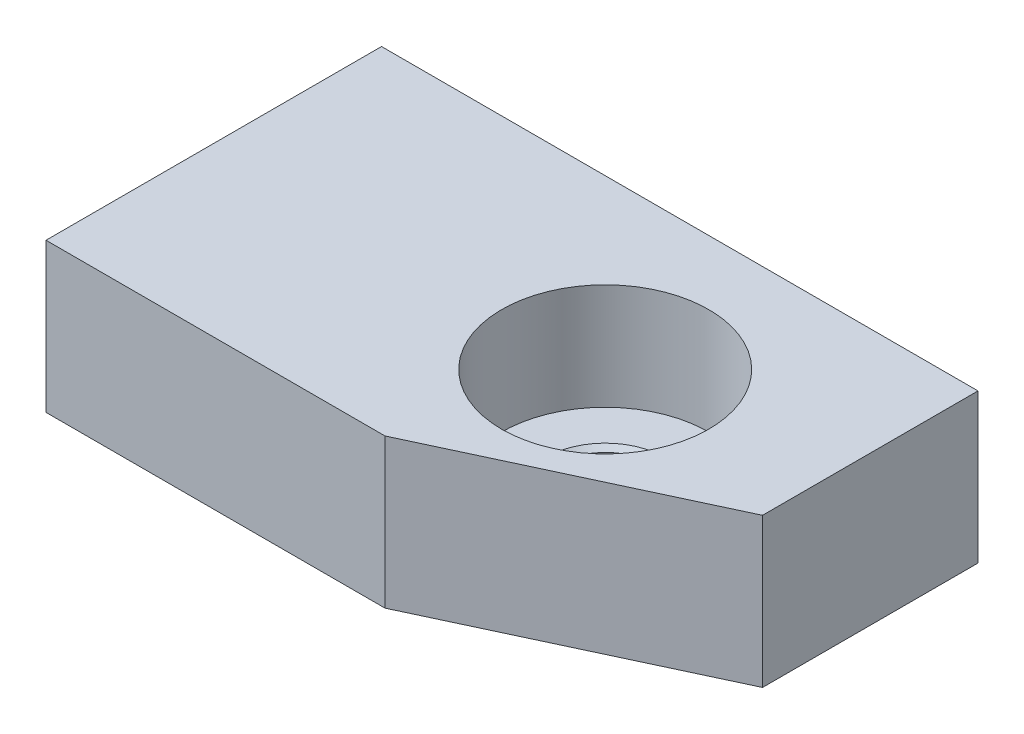
ISO-10303-21;
HEADER;
FILE_DESCRIPTION(('STEP AP214'),'2;1');
FILE_NAME('part.step','',(''),(''),'','','');
FILE_SCHEMA(('AUTOMOTIVE_DESIGN { 1 0 10303 214 1 1 1 1 }'));
ENDSEC;
DATA;
#1=APPLICATION_CONTEXT('core data for automotive mechanical design processes');
#2=APPLICATION_PROTOCOL_DEFINITION('international standard','automotive_design',2000,#1);
#3=PRODUCT_CONTEXT('',#1,'mechanical');
#4=PRODUCT('Part','Part','',(#3));
#5=PRODUCT_RELATED_PRODUCT_CATEGORY('part','',(#4));
#6=PRODUCT_DEFINITION_FORMATION('','',#4);
#7=PRODUCT_DEFINITION_CONTEXT('part definition',#1,'design');
#8=PRODUCT_DEFINITION('design','',#6,#7);
#9=PRODUCT_DEFINITION_SHAPE('','',#8);
#10=(LENGTH_UNIT() NAMED_UNIT(*) SI_UNIT(.MILLI.,.METRE.));
#11=(NAMED_UNIT(*) PLANE_ANGLE_UNIT() SI_UNIT($,.RADIAN.));
#12=(NAMED_UNIT(*) SI_UNIT($,.STERADIAN.) SOLID_ANGLE_UNIT());
#13=UNCERTAINTY_MEASURE_WITH_UNIT(LENGTH_MEASURE(1.E-05),#10,'distance_accuracy_value','');
#14=(GEOMETRIC_REPRESENTATION_CONTEXT(3) GLOBAL_UNCERTAINTY_ASSIGNED_CONTEXT((#13)) GLOBAL_UNIT_ASSIGNED_CONTEXT((#10,
#11,#12)) REPRESENTATION_CONTEXT('',''));
#15=CARTESIAN_POINT('',(0.,0.,0.));
#16=DIRECTION('',(0.,0.,1.));
#17=DIRECTION('',(1.,0.,0.));
#18=AXIS2_PLACEMENT_3D('',#15,#16,#17);
#19=CARTESIAN_POINT('',(16.,4.,0.));
#20=DIRECTION('',(0.,0.,1.));
#21=DIRECTION('',(1.,0.,0.));
#22=AXIS2_PLACEMENT_3D('',#19,#20,#21);
#23=PLANE('',#22);
#24=DIRECTION('',(-1.,0.,0.));
#25=VECTOR('',#24,1.);
#26=CARTESIAN_POINT('',(16.,0.,0.));
#27=LINE('',#26,#25);
#28=CARTESIAN_POINT('',(16.,0.,0.));
#29=VERTEX_POINT('',#28);
#30=CARTESIAN_POINT('',(0.,0.,0.));
#31=VERTEX_POINT('',#30);
#32=EDGE_CURVE('E105',#29,#31,#27,.T.);
#33=ORIENTED_EDGE('',*,*,#32,.T.);
#34=DIRECTION('',(0.,-1.,0.));
#35=VECTOR('',#34,1.);
#36=CARTESIAN_POINT('',(0.,4.,0.));
#37=LINE('',#36,#35);
#38=CARTESIAN_POINT('',(0.,4.,0.));
#39=VERTEX_POINT('',#38);
#40=EDGE_CURVE('E11',#39,#31,#37,.T.);
#41=ORIENTED_EDGE('',*,*,#40,.F.);
#42=DIRECTION('',(-1.,0.,0.));
#43=VECTOR('',#42,1.);
#44=CARTESIAN_POINT('',(16.,4.,0.));
#45=LINE('',#44,#43);
#46=CARTESIAN_POINT('',(16.,4.,0.));
#47=VERTEX_POINT('',#46);
#48=EDGE_CURVE('E114',#47,#39,#45,.T.);
#49=ORIENTED_EDGE('',*,*,#48,.F.);
#50=DIRECTION('',(0.,-1.,0.));
#51=VECTOR('',#50,1.);
#52=CARTESIAN_POINT('',(16.,4.,0.));
#53=LINE('',#52,#51);
#54=EDGE_CURVE('E101',#47,#29,#53,.T.);
#55=ORIENTED_EDGE('',*,*,#54,.T.);
#56=EDGE_LOOP('',(#33,#41,#49,#55));
#57=FACE_BOUND('',#56,.T.);
#58=ADVANCED_FACE('F31',(#57),#23,.F.);
#59=CARTESIAN_POINT('',(0.,4.,0.));
#60=DIRECTION('',(1.,0.,0.));
#61=DIRECTION('',(0.,0.,-1.));
#62=AXIS2_PLACEMENT_3D('',#59,#60,#61);
#63=PLANE('',#62);
#64=DIRECTION('',(0.,0.,1.));
#65=VECTOR('',#64,1.);
#66=CARTESIAN_POINT('',(0.,0.,0.));
#67=LINE('',#66,#65);
#68=CARTESIAN_POINT('',(0.,0.,9.));
#69=VERTEX_POINT('',#68);
#70=EDGE_CURVE('E108',#31,#69,#67,.T.);
#71=ORIENTED_EDGE('',*,*,#70,.T.);
#72=DIRECTION('',(0.,-1.,0.));
#73=VECTOR('',#72,1.);
#74=CARTESIAN_POINT('',(0.,4.,9.));
#75=LINE('',#74,#73);
#76=CARTESIAN_POINT('',(0.,4.,9.));
#77=VERTEX_POINT('',#76);
#78=EDGE_CURVE('E39',#77,#69,#75,.T.);
#79=ORIENTED_EDGE('',*,*,#78,.F.);
#80=DIRECTION('',(0.,0.,1.));
#81=VECTOR('',#80,1.);
#82=CARTESIAN_POINT('',(0.,4.,0.));
#83=LINE('',#82,#81);
#84=EDGE_CURVE('E81',#39,#77,#83,.T.);
#85=ORIENTED_EDGE('',*,*,#84,.F.);
#86=ORIENTED_EDGE('',*,*,#40,.T.);
#87=EDGE_LOOP('',(#71,#79,#85,#86));
#88=FACE_BOUND('',#87,.T.);
#89=ADVANCED_FACE('F134',(#88),#63,.F.);
#90=CARTESIAN_POINT('',(0.,4.,9.));
#91=DIRECTION('',(0.,0.,-1.));
#92=DIRECTION('',(-1.,0.,0.));
#93=AXIS2_PLACEMENT_3D('',#90,#91,#92);
#94=PLANE('',#93);
#95=DIRECTION('',(1.,0.,0.));
#96=VECTOR('',#95,1.);
#97=CARTESIAN_POINT('',(0.,0.,9.));
#98=LINE('',#97,#96);
#99=CARTESIAN_POINT('',(9.09385671324402,0.,9.));
#100=VERTEX_POINT('',#99);
#101=EDGE_CURVE('E96',#69,#100,#98,.T.);
#102=ORIENTED_EDGE('',*,*,#101,.T.);
#103=DIRECTION('',(0.,-1.,0.));
#104=VECTOR('',#103,1.);
#105=CARTESIAN_POINT('',(9.09385671324402,4.,9.));
#106=LINE('',#105,#104);
#107=CARTESIAN_POINT('',(9.09385671324402,4.,9.));
#108=VERTEX_POINT('',#107);
#109=EDGE_CURVE('E93',#108,#100,#106,.T.);
#110=ORIENTED_EDGE('',*,*,#109,.F.);
#111=DIRECTION('',(1.,0.,0.));
#112=VECTOR('',#111,1.);
#113=CARTESIAN_POINT('',(0.,4.,9.));
#114=LINE('',#113,#112);
#115=EDGE_CURVE('E85',#77,#108,#114,.T.);
#116=ORIENTED_EDGE('',*,*,#115,.F.);
#117=ORIENTED_EDGE('',*,*,#78,.T.);
#118=EDGE_LOOP('',(#102,#110,#116,#117));
#119=FACE_BOUND('',#118,.T.);
#120=ADVANCED_FACE('F94',(#119),#94,.F.);
#121=CARTESIAN_POINT('',(9.09385671324402,4.,9.));
#122=DIRECTION('',(-0.422618261740694,0.,-0.906307787036652));
#123=DIRECTION('',(-0.906307787036653,0.,0.422618261740694));
#124=AXIS2_PLACEMENT_3D('',#121,#122,#123);
#125=PLANE('',#124);
#126=DIRECTION('',(0.906307787036653,0.,-0.422618261740694));
#127=VECTOR('',#126,1.);
#128=CARTESIAN_POINT('',(9.09385671324402,0.,9.));
#129=LINE('',#128,#127);
#130=CARTESIAN_POINT('',(16.,0.,5.77961249707001));
#131=VERTEX_POINT('',#130);
#132=EDGE_CURVE('E67',#100,#131,#129,.T.);
#133=ORIENTED_EDGE('',*,*,#132,.T.);
#134=DIRECTION('',(0.,-1.,0.));
#135=VECTOR('',#134,1.);
#136=CARTESIAN_POINT('',(16.,4.,5.77961249707001));
#137=LINE('',#136,#135);
#138=CARTESIAN_POINT('',(16.,4.,5.77961249707001));
#139=VERTEX_POINT('',#138);
#140=EDGE_CURVE('E97',#139,#131,#137,.T.);
#141=ORIENTED_EDGE('',*,*,#140,.F.);
#142=DIRECTION('',(0.906307787036653,0.,-0.422618261740694));
#143=VECTOR('',#142,1.);
#144=CARTESIAN_POINT('',(9.09385671324402,4.,9.));
#145=LINE('',#144,#143);
#146=EDGE_CURVE('E89',#108,#139,#145,.T.);
#147=ORIENTED_EDGE('',*,*,#146,.F.);
#148=ORIENTED_EDGE('',*,*,#109,.T.);
#149=EDGE_LOOP('',(#133,#141,#147,#148));
#150=FACE_BOUND('',#149,.T.);
#151=ADVANCED_FACE('F99',(#150),#125,.F.);
#152=CARTESIAN_POINT('',(16.,4.,5.77961249707001));
#153=DIRECTION('',(-1.,0.,0.));
#154=DIRECTION('',(0.,0.,1.));
#155=AXIS2_PLACEMENT_3D('',#152,#153,#154);
#156=PLANE('',#155);
#157=DIRECTION('',(0.,0.,-1.));
#158=VECTOR('',#157,1.);
#159=CARTESIAN_POINT('',(16.,0.,5.77961249707001));
#160=LINE('',#159,#158);
#161=EDGE_CURVE('E73',#131,#29,#160,.T.);
#162=ORIENTED_EDGE('',*,*,#161,.T.);
#163=ORIENTED_EDGE('',*,*,#54,.F.);
#164=DIRECTION('',(0.,0.,-1.));
#165=VECTOR('',#164,1.);
#166=CARTESIAN_POINT('',(16.,4.,5.77961249707001));
#167=LINE('',#166,#165);
#168=EDGE_CURVE('E47',#139,#47,#167,.T.);
#169=ORIENTED_EDGE('',*,*,#168,.F.);
#170=ORIENTED_EDGE('',*,*,#140,.T.);
#171=EDGE_LOOP('',(#162,#163,#169,#170));
#172=FACE_BOUND('',#171,.T.);
#173=ADVANCED_FACE('F122',(#172),#156,.F.);
#174=CARTESIAN_POINT('',(0.,4.,0.));
#175=DIRECTION('',(0.,1.,0.));
#176=DIRECTION('',(0.,0.,1.));
#177=AXIS2_PLACEMENT_3D('',#174,#175,#176);
#178=PLANE('',#177);
#179=CARTESIAN_POINT('',(10.5,4.,4.5));
#180=DIRECTION('',(0.,1.,0.));
#181=DIRECTION('',(0.,0.,1.));
#182=AXIS2_PLACEMENT_3D('',#179,#180,#181);
#183=CIRCLE('',#182,2.77875999999999);
#184=CARTESIAN_POINT('',(10.5,4.,7.27875999999999));
#185=VERTEX_POINT('',#184);
#186=EDGE_CURVE('E226',#185,#185,#183,.T.);
#187=ORIENTED_EDGE('',*,*,#186,.F.);
#188=EDGE_LOOP('',(#187));
#189=FACE_BOUND('',#188,.T.);
#190=ORIENTED_EDGE('',*,*,#48,.T.);
#191=ORIENTED_EDGE('',*,*,#84,.T.);
#192=ORIENTED_EDGE('',*,*,#115,.T.);
#193=ORIENTED_EDGE('',*,*,#146,.T.);
#194=ORIENTED_EDGE('',*,*,#168,.T.);
#195=EDGE_LOOP('',(#190,#191,#192,#193,#194));
#196=FACE_BOUND('',#195,.T.);
#197=ADVANCED_FACE('F87',(#189,#196),#178,.T.);
#198=CARTESIAN_POINT('',(0.,0.,0.));
#199=DIRECTION('',(0.,1.,0.));
#200=DIRECTION('',(0.,0.,1.));
#201=AXIS2_PLACEMENT_3D('',#198,#199,#200);
#202=PLANE('',#201);
#203=CARTESIAN_POINT('',(10.5,0.,4.5));
#204=DIRECTION('',(0.,1.,0.));
#205=DIRECTION('',(0.,0.,1.));
#206=AXIS2_PLACEMENT_3D('',#203,#204,#205);
#207=CIRCLE('',#206,1.6002);
#208=CARTESIAN_POINT('',(10.5,0.,6.1002));
#209=VERTEX_POINT('',#208);
#210=EDGE_CURVE('E227',#209,#209,#207,.T.);
#211=ORIENTED_EDGE('',*,*,#210,.T.);
#212=EDGE_LOOP('',(#211));
#213=FACE_BOUND('',#212,.T.);
#214=ORIENTED_EDGE('',*,*,#32,.F.);
#215=ORIENTED_EDGE('',*,*,#161,.F.);
#216=ORIENTED_EDGE('',*,*,#132,.F.);
#217=ORIENTED_EDGE('',*,*,#101,.F.);
#218=ORIENTED_EDGE('',*,*,#70,.F.);
#219=EDGE_LOOP('',(#214,#215,#216,#217,#218));
#220=FACE_BOUND('',#219,.T.);
#221=ADVANCED_FACE('F118',(#213,#220),#202,.F.);
#222=CARTESIAN_POINT('',(10.5,0.127,4.5));
#223=DIRECTION('',(0.,-1.,0.));
#224=DIRECTION('',(0.,0.,-1.));
#225=AXIS2_PLACEMENT_3D('',#222,#223,#224);
#226=CONICAL_SURFACE('',#225,1.4732,0.785398163397448);
#227=ORIENTED_EDGE('',*,*,#210,.F.);
#228=EDGE_LOOP('',(#227));
#229=FACE_BOUND('',#228,.T.);
#230=CARTESIAN_POINT('',(10.5,0.127,4.5));
#231=DIRECTION('',(0.,1.,0.));
#232=DIRECTION('',(0.,0.,1.));
#233=AXIS2_PLACEMENT_3D('',#230,#231,#232);
#234=CIRCLE('',#233,1.4732);
#235=CARTESIAN_POINT('',(10.5,0.127,5.9732));
#236=VERTEX_POINT('',#235);
#237=EDGE_CURVE('E109',#236,#236,#234,.T.);
#238=ORIENTED_EDGE('',*,*,#237,.T.);
#239=EDGE_LOOP('',(#238));
#240=FACE_BOUND('',#239,.T.);
#241=ADVANCED_FACE('F167',(#229,#240),#226,.F.);
#242=CARTESIAN_POINT('',(10.5,4.,4.5));
#243=DIRECTION('',(0.,1.,0.));
#244=DIRECTION('',(0.,0.,1.));
#245=AXIS2_PLACEMENT_3D('',#242,#243,#244);
#246=CYLINDRICAL_SURFACE('',#245,1.4732);
#247=ORIENTED_EDGE('',*,*,#237,.F.);
#248=EDGE_LOOP('',(#247));
#249=FACE_BOUND('',#248,.T.);
#250=CARTESIAN_POINT('',(10.5,1.02819999999999,4.5));
#251=DIRECTION('',(0.,1.,0.));
#252=DIRECTION('',(0.,0.,1.));
#253=AXIS2_PLACEMENT_3D('',#250,#251,#252);
#254=CIRCLE('',#253,1.4732);
#255=CARTESIAN_POINT('',(10.5,1.02819999999999,5.9732));
#256=VERTEX_POINT('',#255);
#257=EDGE_CURVE('E236',#256,#256,#254,.T.);
#258=ORIENTED_EDGE('',*,*,#257,.T.);
#259=EDGE_LOOP('',(#258));
#260=FACE_BOUND('',#259,.T.);
#261=ADVANCED_FACE('F176',(#249,#260),#246,.F.);
#262=CARTESIAN_POINT('',(10.5,1.1552,4.5));
#263=DIRECTION('',(0.,1.,0.));
#264=DIRECTION('',(0.,0.,1.));
#265=AXIS2_PLACEMENT_3D('',#262,#263,#264);
#266=CONICAL_SURFACE('',#265,1.6002,0.785398163397414);
#267=ORIENTED_EDGE('',*,*,#257,.F.);
#268=EDGE_LOOP('',(#267));
#269=FACE_BOUND('',#268,.T.);
#270=CARTESIAN_POINT('',(10.5,1.1552,4.5));
#271=DIRECTION('',(0.,1.,0.));
#272=DIRECTION('',(0.,0.,1.));
#273=AXIS2_PLACEMENT_3D('',#270,#271,#272);
#274=CIRCLE('',#273,1.6002);
#275=CARTESIAN_POINT('',(10.5,1.1552,6.1002));
#276=VERTEX_POINT('',#275);
#277=EDGE_CURVE('E229',#276,#276,#274,.T.);
#278=ORIENTED_EDGE('',*,*,#277,.T.);
#279=EDGE_LOOP('',(#278));
#280=FACE_BOUND('',#279,.T.);
#281=ADVANCED_FACE('F186',(#269,#280),#266,.F.);
#282=CARTESIAN_POINT('',(12.1002,1.1552,4.5));
#283=DIRECTION('',(0.,-1.,0.));
#284=DIRECTION('',(0.,0.,-1.));
#285=AXIS2_PLACEMENT_3D('',#282,#283,#284);
#286=PLANE('',#285);
#287=ORIENTED_EDGE('',*,*,#277,.F.);
#288=EDGE_LOOP('',(#287));
#289=FACE_BOUND('',#288,.T.);
#290=CARTESIAN_POINT('',(10.5,1.15520000000001,4.5));
#291=DIRECTION('',(0.,1.,0.));
#292=DIRECTION('',(0.,0.,1.));
#293=AXIS2_PLACEMENT_3D('',#290,#291,#292);
#294=CIRCLE('',#293,2.77875999999999);
#295=CARTESIAN_POINT('',(10.5,1.15520000000001,7.27875999999999));
#296=VERTEX_POINT('',#295);
#297=EDGE_CURVE('E223',#296,#296,#294,.T.);
#298=ORIENTED_EDGE('',*,*,#297,.T.);
#299=EDGE_LOOP('',(#298));
#300=FACE_BOUND('',#299,.T.);
#301=ADVANCED_FACE('F196',(#289,#300),#286,.F.);
#302=CARTESIAN_POINT('',(10.5,4.,4.5));
#303=DIRECTION('',(0.,1.,0.));
#304=DIRECTION('',(0.,0.,1.));
#305=AXIS2_PLACEMENT_3D('',#302,#303,#304);
#306=CYLINDRICAL_SURFACE('',#305,2.77875999999999);
#307=ORIENTED_EDGE('',*,*,#297,.F.);
#308=EDGE_LOOP('',(#307));
#309=FACE_BOUND('',#308,.T.);
#310=ORIENTED_EDGE('',*,*,#186,.T.);
#311=EDGE_LOOP('',(#310));
#312=FACE_BOUND('',#311,.T.);
#313=ADVANCED_FACE('F206',(#309,#312),#306,.F.);
#314=CLOSED_SHELL('',(#58,#89,#120,#151,#173,#197,#221,#241,#261,#281,#301,#313));
#315=MANIFOLD_SOLID_BREP('B2',#314);
#316=ADVANCED_BREP_SHAPE_REPRESENTATION('',(#18,#315),#14);
#317=SHAPE_DEFINITION_REPRESENTATION(#9,#316);
ENDSEC;
END-ISO-10303-21;
